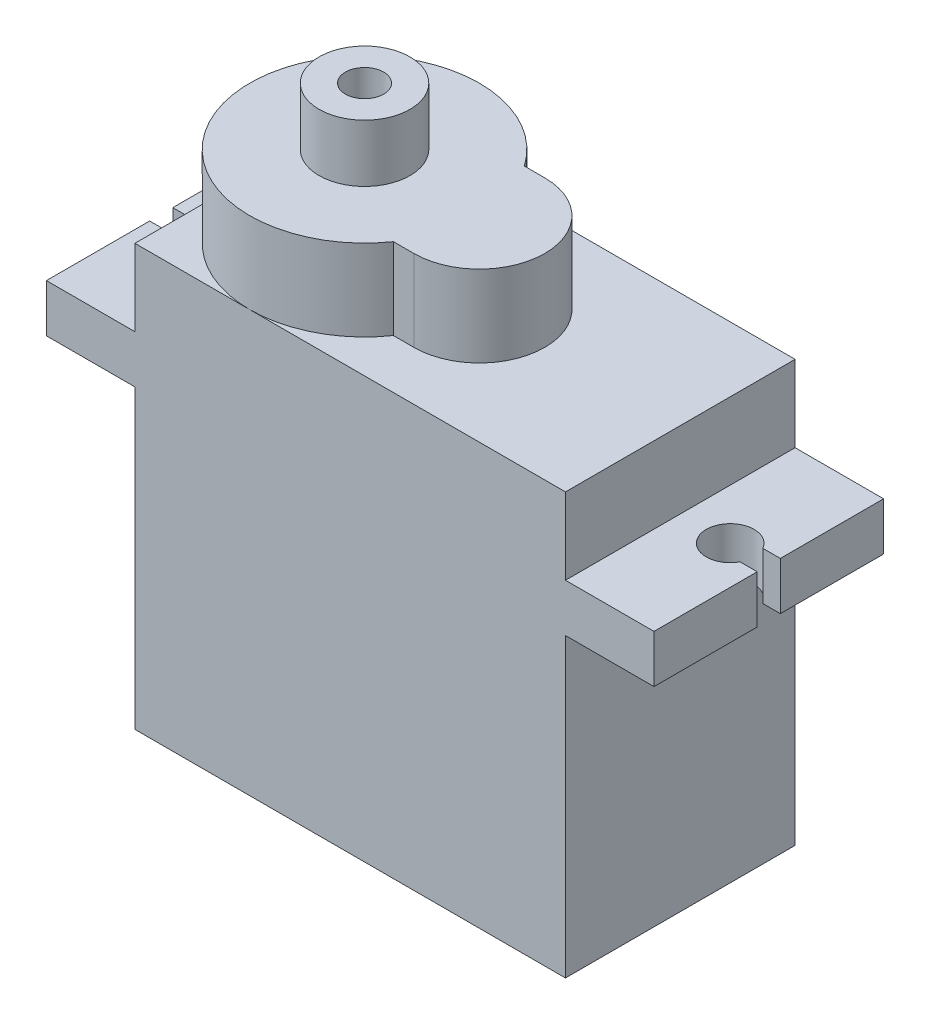
ISO-10303-21;
HEADER;
FILE_DESCRIPTION(('STEP AP214'),'2;1');
FILE_NAME('part.step','',(''),(''),'','','');
FILE_SCHEMA(('AUTOMOTIVE_DESIGN { 1 0 10303 214 1 1 1 1 }'));
ENDSEC;
DATA;
#1=APPLICATION_CONTEXT('core data for automotive mechanical design processes');
#2=APPLICATION_PROTOCOL_DEFINITION('international standard','automotive_design',2000,#1);
#3=PRODUCT_CONTEXT('',#1,'mechanical');
#4=PRODUCT('Part','Part','',(#3));
#5=PRODUCT_RELATED_PRODUCT_CATEGORY('part','',(#4));
#6=PRODUCT_DEFINITION_FORMATION('','',#4);
#7=PRODUCT_DEFINITION_CONTEXT('part definition',#1,'design');
#8=PRODUCT_DEFINITION('design','',#6,#7);
#9=PRODUCT_DEFINITION_SHAPE('','',#8);
#10=(LENGTH_UNIT() NAMED_UNIT(*) SI_UNIT(.MILLI.,.METRE.));
#11=(NAMED_UNIT(*) PLANE_ANGLE_UNIT() SI_UNIT($,.RADIAN.));
#12=(NAMED_UNIT(*) SI_UNIT($,.STERADIAN.) SOLID_ANGLE_UNIT());
#13=UNCERTAINTY_MEASURE_WITH_UNIT(LENGTH_MEASURE(1.E-05),#10,'distance_accuracy_value','');
#14=(GEOMETRIC_REPRESENTATION_CONTEXT(3) GLOBAL_UNCERTAINTY_ASSIGNED_CONTEXT((#13)) GLOBAL_UNIT_ASSIGNED_CONTEXT((#10,
#11,#12)) REPRESENTATION_CONTEXT('',''));
#15=CARTESIAN_POINT('',(0.,0.,0.));
#16=DIRECTION('',(0.,0.,1.));
#17=DIRECTION('',(1.,0.,0.));
#18=AXIS2_PLACEMENT_3D('',#15,#16,#17);
#19=CARTESIAN_POINT('',(11.43,22.352,6.096));
#20=DIRECTION('',(-1.,0.,0.));
#21=DIRECTION('',(0.,0.,1.));
#22=AXIS2_PLACEMENT_3D('',#19,#20,#21);
#23=PLANE('',#22);
#24=DIRECTION('',(0.,0.,1.));
#25=VECTOR('',#24,1.);
#26=CARTESIAN_POINT('',(11.43,18.288,6.096));
#27=LINE('',#26,#25);
#28=CARTESIAN_POINT('',(11.43,18.288,-6.096));
#29=VERTEX_POINT('',#28);
#30=CARTESIAN_POINT('',(11.43,18.288,6.096));
#31=VERTEX_POINT('',#30);
#32=EDGE_CURVE('E234',#29,#31,#27,.T.);
#33=ORIENTED_EDGE('',*,*,#32,.F.);
#34=DIRECTION('',(0.,-1.,0.));
#35=VECTOR('',#34,1.);
#36=CARTESIAN_POINT('',(11.43,22.352,-6.096));
#37=LINE('',#36,#35);
#38=CARTESIAN_POINT('',(11.43,22.352,-6.096));
#39=VERTEX_POINT('',#38);
#40=EDGE_CURVE('E470',#39,#29,#37,.T.);
#41=ORIENTED_EDGE('',*,*,#40,.F.);
#42=DIRECTION('',(0.,0.,-1.));
#43=VECTOR('',#42,1.);
#44=CARTESIAN_POINT('',(11.43,22.352,6.096));
#45=LINE('',#44,#43);
#46=CARTESIAN_POINT('',(11.43,22.352,6.096));
#47=VERTEX_POINT('',#46);
#48=EDGE_CURVE('E422',#47,#39,#45,.T.);
#49=ORIENTED_EDGE('',*,*,#48,.F.);
#50=DIRECTION('',(0.,-1.,0.));
#51=VECTOR('',#50,1.);
#52=CARTESIAN_POINT('',(11.43,22.352,6.096));
#53=LINE('',#52,#51);
#54=EDGE_CURVE('E457',#47,#31,#53,.T.);
#55=ORIENTED_EDGE('',*,*,#54,.T.);
#56=EDGE_LOOP('',(#33,#41,#49,#55));
#57=FACE_BOUND('',#56,.T.);
#58=ADVANCED_FACE('F41',(#57),#23,.F.);
#59=CARTESIAN_POINT('',(-11.43,22.352,6.096));
#60=DIRECTION('',(1.,0.,0.));
#61=DIRECTION('',(0.,0.,-1.));
#62=AXIS2_PLACEMENT_3D('',#59,#60,#61);
#63=PLANE('',#62);
#64=DIRECTION('',(0.,0.,-1.));
#65=VECTOR('',#64,1.);
#66=CARTESIAN_POINT('',(-11.43,18.288,6.096));
#67=LINE('',#66,#65);
#68=CARTESIAN_POINT('',(-11.43,18.288,6.096));
#69=VERTEX_POINT('',#68);
#70=CARTESIAN_POINT('',(-11.43,18.288,-6.096));
#71=VERTEX_POINT('',#70);
#72=EDGE_CURVE('E370',#69,#71,#67,.T.);
#73=ORIENTED_EDGE('',*,*,#72,.F.);
#74=DIRECTION('',(0.,-1.,0.));
#75=VECTOR('',#74,1.);
#76=CARTESIAN_POINT('',(-11.43,22.352,6.096));
#77=LINE('',#76,#75);
#78=CARTESIAN_POINT('',(-11.43,22.352,6.096));
#79=VERTEX_POINT('',#78);
#80=EDGE_CURVE('E461',#79,#69,#77,.T.);
#81=ORIENTED_EDGE('',*,*,#80,.F.);
#82=DIRECTION('',(0.,0.,1.));
#83=VECTOR('',#82,1.);
#84=CARTESIAN_POINT('',(-11.43,22.352,6.096));
#85=LINE('',#84,#83);
#86=CARTESIAN_POINT('',(-11.43,22.352,0.));
#87=VERTEX_POINT('',#86);
#88=EDGE_CURVE('E432',#87,#79,#85,.T.);
#89=ORIENTED_EDGE('',*,*,#88,.F.);
#90=CARTESIAN_POINT('',(-11.43,22.352,-6.096));
#91=VERTEX_POINT('',#90);
#92=EDGE_CURVE('E433',#91,#87,#85,.T.);
#93=ORIENTED_EDGE('',*,*,#92,.F.);
#94=DIRECTION('',(0.,-1.,0.));
#95=VECTOR('',#94,1.);
#96=CARTESIAN_POINT('',(-11.43,22.352,-6.096));
#97=LINE('',#96,#95);
#98=EDGE_CURVE('E466',#91,#71,#97,.T.);
#99=ORIENTED_EDGE('',*,*,#98,.T.);
#100=EDGE_LOOP('',(#73,#81,#89,#93,#99));
#101=FACE_BOUND('',#100,.T.);
#102=ADVANCED_FACE('F542',(#101),#63,.F.);
#103=CARTESIAN_POINT('',(0.,22.352,0.));
#104=DIRECTION('',(0.,-1.,0.));
#105=DIRECTION('',(0.,0.,-1.));
#106=AXIS2_PLACEMENT_3D('',#103,#104,#105);
#107=PLANE('',#106);
#108=CARTESIAN_POINT('',(-5.334,22.352,0.));
#109=DIRECTION('',(0.,1.,0.));
#110=DIRECTION('',(0.,0.,1.));
#111=AXIS2_PLACEMENT_3D('',#108,#109,#110);
#112=CIRCLE('',#111,6.096);
#113=CARTESIAN_POINT('',(-0.325986717155687,22.352,-3.47577602253869));
#114=VERTEX_POINT('',#113);
#115=CARTESIAN_POINT('',(-5.334,22.352,-6.096));
#116=VERTEX_POINT('',#115);
#117=EDGE_CURVE('E375',#114,#116,#112,.T.);
#118=ORIENTED_EDGE('',*,*,#117,.F.);
#119=DIRECTION('',(-1.,0.,0.));
#120=VECTOR('',#119,1.);
#121=CARTESIAN_POINT('',(0.761999999999996,22.352,-3.47577602253869));
#122=LINE('',#121,#120);
#123=CARTESIAN_POINT('',(0.761999999999997,22.352,-3.47577602253869));
#124=VERTEX_POINT('',#123);
#125=EDGE_CURVE('E381',#124,#114,#122,.T.);
#126=ORIENTED_EDGE('',*,*,#125,.F.);
#127=CARTESIAN_POINT('',(0.761999999999996,22.352,0.));
#128=DIRECTION('',(0.,1.,0.));
#129=DIRECTION('',(0.,0.,1.));
#130=AXIS2_PLACEMENT_3D('',#127,#128,#129);
#131=CIRCLE('',#130,3.47577602253869);
#132=CARTESIAN_POINT('',(0.761999999999996,22.352,3.47577602253869));
#133=VERTEX_POINT('',#132);
#134=EDGE_CURVE('E399',#133,#124,#131,.T.);
#135=ORIENTED_EDGE('',*,*,#134,.F.);
#136=DIRECTION('',(1.,0.,0.));
#137=VECTOR('',#136,1.);
#138=CARTESIAN_POINT('',(0.761999999999996,22.352,3.47577602253869));
#139=LINE('',#138,#137);
#140=CARTESIAN_POINT('',(-0.325986717155687,22.352,3.47577602253869));
#141=VERTEX_POINT('',#140);
#142=EDGE_CURVE('E394',#141,#133,#139,.T.);
#143=ORIENTED_EDGE('',*,*,#142,.F.);
#144=CARTESIAN_POINT('',(-5.334,22.352,6.096));
#145=VERTEX_POINT('',#144);
#146=EDGE_CURVE('E395',#145,#141,#112,.T.);
#147=ORIENTED_EDGE('',*,*,#146,.F.);
#148=DIRECTION('',(1.,0.,0.));
#149=VECTOR('',#148,1.);
#150=CARTESIAN_POINT('',(-11.43,22.352,6.096));
#151=LINE('',#150,#149);
#152=EDGE_CURVE('E437',#145,#47,#151,.T.);
#153=ORIENTED_EDGE('',*,*,#152,.T.);
#154=ORIENTED_EDGE('',*,*,#48,.T.);
#155=DIRECTION('',(-1.,0.,0.));
#156=VECTOR('',#155,1.);
#157=CARTESIAN_POINT('',(-11.43,22.352,-6.096));
#158=LINE('',#157,#156);
#159=EDGE_CURVE('E428',#39,#116,#158,.T.);
#160=ORIENTED_EDGE('',*,*,#159,.T.);
#161=EDGE_LOOP('',(#118,#126,#135,#143,#147,#153,#154,#160));
#162=FACE_BOUND('',#161,.T.);
#163=ADVANCED_FACE('F547',(#162),#107,.F.);
#164=EDGE_CURVE('E50',#116,#87,#112,.T.);
#165=ORIENTED_EDGE('',*,*,#164,.F.);
#166=EDGE_CURVE('E426',#116,#91,#158,.T.);
#167=ORIENTED_EDGE('',*,*,#166,.T.);
#168=ORIENTED_EDGE('',*,*,#92,.T.);
#169=EDGE_LOOP('',(#165,#167,#168));
#170=FACE_BOUND('',#169,.T.);
#171=ADVANCED_FACE('F556',(#170),#107,.F.);
#172=EDGE_CURVE('E478',#87,#145,#112,.T.);
#173=ORIENTED_EDGE('',*,*,#172,.F.);
#174=ORIENTED_EDGE('',*,*,#88,.T.);
#175=EDGE_CURVE('E438',#79,#145,#151,.T.);
#176=ORIENTED_EDGE('',*,*,#175,.T.);
#177=EDGE_LOOP('',(#173,#174,#176));
#178=FACE_BOUND('',#177,.T.);
#179=ADVANCED_FACE('F551',(#178),#107,.F.);
#180=CARTESIAN_POINT('',(11.43,15.748,-6.096));
#181=VERTEX_POINT('',#180);
#182=CARTESIAN_POINT('',(11.43,0.,-6.096));
#183=VERTEX_POINT('',#182);
#184=EDGE_CURVE('E469',#181,#183,#37,.T.);
#185=ORIENTED_EDGE('',*,*,#184,.F.);
#186=DIRECTION('',(0.,0.,1.));
#187=VECTOR('',#186,1.);
#188=CARTESIAN_POINT('',(11.43,15.748,6.096));
#189=LINE('',#188,#187);
#190=CARTESIAN_POINT('',(11.43,15.748,6.096));
#191=VERTEX_POINT('',#190);
#192=EDGE_CURVE('E367',#181,#191,#189,.T.);
#193=ORIENTED_EDGE('',*,*,#192,.T.);
#194=CARTESIAN_POINT('',(11.43,0.,6.096));
#195=VERTEX_POINT('',#194);
#196=EDGE_CURVE('E442',#191,#195,#53,.T.);
#197=ORIENTED_EDGE('',*,*,#196,.T.);
#198=DIRECTION('',(0.,0.,-1.));
#199=VECTOR('',#198,1.);
#200=CARTESIAN_POINT('',(11.43,0.,6.096));
#201=LINE('',#200,#199);
#202=EDGE_CURVE('E421',#195,#183,#201,.T.);
#203=ORIENTED_EDGE('',*,*,#202,.T.);
#204=EDGE_LOOP('',(#185,#193,#197,#203));
#205=FACE_BOUND('',#204,.T.);
#206=ADVANCED_FACE('F43',(#205),#23,.F.);
#207=CARTESIAN_POINT('',(-11.43,22.352,-6.096));
#208=DIRECTION('',(0.,0.,1.));
#209=DIRECTION('',(1.,0.,0.));
#210=AXIS2_PLACEMENT_3D('',#207,#208,#209);
#211=PLANE('',#210);
#212=CARTESIAN_POINT('',(-11.43,15.748,-6.096));
#213=VERTEX_POINT('',#212);
#214=CARTESIAN_POINT('',(-11.43,0.,-6.096));
#215=VERTEX_POINT('',#214);
#216=EDGE_CURVE('E465',#213,#215,#97,.T.);
#217=ORIENTED_EDGE('',*,*,#216,.F.);
#218=DIRECTION('',(1.,0.,0.));
#219=VECTOR('',#218,1.);
#220=CARTESIAN_POINT('',(-16.129,15.748,-6.096));
#221=LINE('',#220,#219);
#222=CARTESIAN_POINT('',(-16.129,15.748,-6.096));
#223=VERTEX_POINT('',#222);
#224=EDGE_CURVE('E57',#223,#213,#221,.T.);
#225=ORIENTED_EDGE('',*,*,#224,.F.);
#226=DIRECTION('',(0.,-1.,0.));
#227=VECTOR('',#226,1.);
#228=CARTESIAN_POINT('',(-16.129,18.288,-6.096));
#229=LINE('',#228,#227);
#230=CARTESIAN_POINT('',(-16.129,18.288,-6.096));
#231=VERTEX_POINT('',#230);
#232=EDGE_CURVE('E347',#231,#223,#229,.T.);
#233=ORIENTED_EDGE('',*,*,#232,.F.);
#234=DIRECTION('',(1.,0.,0.));
#235=VECTOR('',#234,1.);
#236=CARTESIAN_POINT('',(-16.129,18.288,-6.096));
#237=LINE('',#236,#235);
#238=EDGE_CURVE('E273',#231,#71,#237,.T.);
#239=ORIENTED_EDGE('',*,*,#238,.T.);
#240=ORIENTED_EDGE('',*,*,#98,.F.);
#241=ORIENTED_EDGE('',*,*,#166,.F.);
#242=ORIENTED_EDGE('',*,*,#159,.F.);
#243=ORIENTED_EDGE('',*,*,#40,.T.);
#244=CARTESIAN_POINT('',(16.129,18.288,-6.096));
#245=VERTEX_POINT('',#244);
#246=EDGE_CURVE('E272',#29,#245,#237,.T.);
#247=ORIENTED_EDGE('',*,*,#246,.T.);
#248=DIRECTION('',(0.,-1.,0.));
#249=VECTOR('',#248,1.);
#250=CARTESIAN_POINT('',(16.129,18.288,-6.096));
#251=LINE('',#250,#249);
#252=CARTESIAN_POINT('',(16.129,15.748,-6.096));
#253=VERTEX_POINT('',#252);
#254=EDGE_CURVE('E343',#245,#253,#251,.T.);
#255=ORIENTED_EDGE('',*,*,#254,.T.);
#256=EDGE_CURVE('E317',#181,#253,#221,.T.);
#257=ORIENTED_EDGE('',*,*,#256,.F.);
#258=ORIENTED_EDGE('',*,*,#184,.T.);
#259=DIRECTION('',(-1.,0.,0.));
#260=VECTOR('',#259,1.);
#261=CARTESIAN_POINT('',(-11.43,0.,-6.096));
#262=LINE('',#261,#260);
#263=EDGE_CURVE('E446',#183,#215,#262,.T.);
#264=ORIENTED_EDGE('',*,*,#263,.T.);
#265=EDGE_LOOP('',(#217,#225,#233,#239,#240,#241,#242,#243,#247,#255,#257,#258,#264));
#266=FACE_BOUND('',#265,.T.);
#267=ADVANCED_FACE('F483',(#266),#211,.F.);
#268=CARTESIAN_POINT('',(-11.43,15.748,6.096));
#269=VERTEX_POINT('',#268);
#270=CARTESIAN_POINT('',(-11.43,0.,6.096));
#271=VERTEX_POINT('',#270);
#272=EDGE_CURVE('E460',#269,#271,#77,.T.);
#273=ORIENTED_EDGE('',*,*,#272,.F.);
#274=DIRECTION('',(0.,0.,-1.));
#275=VECTOR('',#274,1.);
#276=CARTESIAN_POINT('',(-11.43,15.748,6.096));
#277=LINE('',#276,#275);
#278=EDGE_CURVE('E333',#269,#213,#277,.T.);
#279=ORIENTED_EDGE('',*,*,#278,.T.);
#280=ORIENTED_EDGE('',*,*,#216,.T.);
#281=DIRECTION('',(0.,0.,1.));
#282=VECTOR('',#281,1.);
#283=CARTESIAN_POINT('',(-11.43,0.,6.096));
#284=LINE('',#283,#282);
#285=EDGE_CURVE('E450',#215,#271,#284,.T.);
#286=ORIENTED_EDGE('',*,*,#285,.T.);
#287=EDGE_LOOP('',(#273,#279,#280,#286));
#288=FACE_BOUND('',#287,.T.);
#289=ADVANCED_FACE('F495',(#288),#63,.F.);
#290=CARTESIAN_POINT('',(-11.43,22.352,6.096));
#291=DIRECTION('',(0.,0.,-1.));
#292=DIRECTION('',(-1.,0.,0.));
#293=AXIS2_PLACEMENT_3D('',#290,#291,#292);
#294=PLANE('',#293);
#295=ORIENTED_EDGE('',*,*,#196,.F.);
#296=DIRECTION('',(-1.,0.,0.));
#297=VECTOR('',#296,1.);
#298=CARTESIAN_POINT('',(-16.129,15.748,6.096));
#299=LINE('',#298,#297);
#300=CARTESIAN_POINT('',(16.129,15.748,6.096));
#301=VERTEX_POINT('',#300);
#302=EDGE_CURVE('E65',#301,#191,#299,.T.);
#303=ORIENTED_EDGE('',*,*,#302,.F.);
#304=DIRECTION('',(0.,-1.,0.));
#305=VECTOR('',#304,1.);
#306=CARTESIAN_POINT('',(16.129,18.288,6.096));
#307=LINE('',#306,#305);
#308=CARTESIAN_POINT('',(16.129,18.288,6.096));
#309=VERTEX_POINT('',#308);
#310=EDGE_CURVE('E213',#309,#301,#307,.T.);
#311=ORIENTED_EDGE('',*,*,#310,.F.);
#312=DIRECTION('',(-1.,0.,0.));
#313=VECTOR('',#312,1.);
#314=CARTESIAN_POINT('',(-16.129,18.288,6.096));
#315=LINE('',#314,#313);
#316=EDGE_CURVE('E218',#309,#31,#315,.T.);
#317=ORIENTED_EDGE('',*,*,#316,.T.);
#318=ORIENTED_EDGE('',*,*,#54,.F.);
#319=ORIENTED_EDGE('',*,*,#152,.F.);
#320=ORIENTED_EDGE('',*,*,#175,.F.);
#321=ORIENTED_EDGE('',*,*,#80,.T.);
#322=CARTESIAN_POINT('',(-16.129,18.288,6.096));
#323=VERTEX_POINT('',#322);
#324=EDGE_CURVE('E237',#69,#323,#315,.T.);
#325=ORIENTED_EDGE('',*,*,#324,.T.);
#326=DIRECTION('',(0.,-1.,0.));
#327=VECTOR('',#326,1.);
#328=CARTESIAN_POINT('',(-16.129,18.288,6.096));
#329=LINE('',#328,#327);
#330=CARTESIAN_POINT('',(-16.129,15.748,6.096));
#331=VERTEX_POINT('',#330);
#332=EDGE_CURVE('E224',#323,#331,#329,.T.);
#333=ORIENTED_EDGE('',*,*,#332,.T.);
#334=EDGE_CURVE('E294',#269,#331,#299,.T.);
#335=ORIENTED_EDGE('',*,*,#334,.F.);
#336=ORIENTED_EDGE('',*,*,#272,.T.);
#337=DIRECTION('',(1.,0.,0.));
#338=VECTOR('',#337,1.);
#339=CARTESIAN_POINT('',(-11.43,0.,6.096));
#340=LINE('',#339,#338);
#341=EDGE_CURVE('E427',#271,#195,#340,.T.);
#342=ORIENTED_EDGE('',*,*,#341,.T.);
#343=EDGE_LOOP('',(#295,#303,#311,#317,#318,#319,#320,#321,#325,#333,#335,#336,#342));
#344=FACE_BOUND('',#343,.T.);
#345=ADVANCED_FACE('F216',(#344),#294,.F.);
#346=CARTESIAN_POINT('',(0.,0.,0.));
#347=DIRECTION('',(0.,-1.,0.));
#348=DIRECTION('',(0.,0.,-1.));
#349=AXIS2_PLACEMENT_3D('',#346,#347,#348);
#350=PLANE('',#349);
#351=ORIENTED_EDGE('',*,*,#202,.F.);
#352=ORIENTED_EDGE('',*,*,#341,.F.);
#353=ORIENTED_EDGE('',*,*,#285,.F.);
#354=ORIENTED_EDGE('',*,*,#263,.F.);
#355=EDGE_LOOP('',(#351,#352,#353,#354));
#356=FACE_BOUND('',#355,.T.);
#357=ADVANCED_FACE('F488',(#356),#350,.T.);
#358=CARTESIAN_POINT('',(-5.334,26.67,0.));
#359=DIRECTION('',(0.,-1.,0.));
#360=DIRECTION('',(0.,0.,-1.));
#361=AXIS2_PLACEMENT_3D('',#358,#359,#360);
#362=CYLINDRICAL_SURFACE('',#361,6.096);
#363=ORIENTED_EDGE('',*,*,#117,.T.);
#364=ORIENTED_EDGE('',*,*,#164,.T.);
#365=ORIENTED_EDGE('',*,*,#172,.T.);
#366=ORIENTED_EDGE('',*,*,#146,.T.);
#367=DIRECTION('',(0.,-1.,0.));
#368=VECTOR('',#367,1.);
#369=CARTESIAN_POINT('',(-0.325986717155687,26.67,3.47577602253869));
#370=LINE('',#369,#368);
#371=CARTESIAN_POINT('',(-0.325986717155687,26.67,3.47577602253869));
#372=VERTEX_POINT('',#371);
#373=EDGE_CURVE('E417',#372,#141,#370,.T.);
#374=ORIENTED_EDGE('',*,*,#373,.F.);
#375=CARTESIAN_POINT('',(-5.334,26.67,0.));
#376=DIRECTION('',(0.,1.,0.));
#377=DIRECTION('',(0.,0.,1.));
#378=AXIS2_PLACEMENT_3D('',#375,#376,#377);
#379=CIRCLE('',#378,6.096);
#380=CARTESIAN_POINT('',(-0.325986717155687,26.67,-3.47577602253869));
#381=VERTEX_POINT('',#380);
#382=EDGE_CURVE('E376',#381,#372,#379,.T.);
#383=ORIENTED_EDGE('',*,*,#382,.F.);
#384=DIRECTION('',(0.,-1.,0.));
#385=VECTOR('',#384,1.);
#386=CARTESIAN_POINT('',(-0.325986717155687,26.67,-3.47577602253869));
#387=LINE('',#386,#385);
#388=EDGE_CURVE('E390',#381,#114,#387,.T.);
#389=ORIENTED_EDGE('',*,*,#388,.T.);
#390=EDGE_LOOP('',(#363,#364,#365,#366,#374,#383,#389));
#391=FACE_BOUND('',#390,.T.);
#392=ADVANCED_FACE('F577',(#391),#362,.T.);
#393=CARTESIAN_POINT('',(0.761999999999996,26.67,3.47577602253869));
#394=DIRECTION('',(0.,0.,-1.));
#395=DIRECTION('',(-1.,0.,0.));
#396=AXIS2_PLACEMENT_3D('',#393,#394,#395);
#397=PLANE('',#396);
#398=ORIENTED_EDGE('',*,*,#142,.T.);
#399=DIRECTION('',(0.,-1.,0.));
#400=VECTOR('',#399,1.);
#401=CARTESIAN_POINT('',(0.761999999999996,26.67,3.47577602253869));
#402=LINE('',#401,#400);
#403=CARTESIAN_POINT('',(0.761999999999996,26.67,3.47577602253869));
#404=VERTEX_POINT('',#403);
#405=EDGE_CURVE('E413',#404,#133,#402,.T.);
#406=ORIENTED_EDGE('',*,*,#405,.F.);
#407=DIRECTION('',(1.,0.,0.));
#408=VECTOR('',#407,1.);
#409=CARTESIAN_POINT('',(0.761999999999996,26.67,3.47577602253869));
#410=LINE('',#409,#408);
#411=EDGE_CURVE('E380',#372,#404,#410,.T.);
#412=ORIENTED_EDGE('',*,*,#411,.F.);
#413=ORIENTED_EDGE('',*,*,#373,.T.);
#414=EDGE_LOOP('',(#398,#406,#412,#413));
#415=FACE_BOUND('',#414,.T.);
#416=ADVANCED_FACE('F586',(#415),#397,.F.);
#417=CARTESIAN_POINT('',(0.761999999999996,26.67,0.));
#418=DIRECTION('',(0.,-1.,0.));
#419=DIRECTION('',(0.,0.,-1.));
#420=AXIS2_PLACEMENT_3D('',#417,#418,#419);
#421=CYLINDRICAL_SURFACE('',#420,3.47577602253869);
#422=ORIENTED_EDGE('',*,*,#134,.T.);
#423=DIRECTION('',(0.,-1.,0.));
#424=VECTOR('',#423,1.);
#425=CARTESIAN_POINT('',(0.761999999999997,26.67,-3.47577602253869));
#426=LINE('',#425,#424);
#427=CARTESIAN_POINT('',(0.761999999999997,26.67,-3.47577602253869));
#428=VERTEX_POINT('',#427);
#429=EDGE_CURVE('E409',#428,#124,#426,.T.);
#430=ORIENTED_EDGE('',*,*,#429,.F.);
#431=CARTESIAN_POINT('',(0.761999999999996,26.67,0.));
#432=DIRECTION('',(0.,1.,0.));
#433=DIRECTION('',(0.,0.,1.));
#434=AXIS2_PLACEMENT_3D('',#431,#432,#433);
#435=CIRCLE('',#434,3.47577602253869);
#436=EDGE_CURVE('E384',#404,#428,#435,.T.);
#437=ORIENTED_EDGE('',*,*,#436,.F.);
#438=ORIENTED_EDGE('',*,*,#405,.T.);
#439=EDGE_LOOP('',(#422,#430,#437,#438));
#440=FACE_BOUND('',#439,.T.);
#441=ADVANCED_FACE('F584',(#440),#421,.T.);
#442=CARTESIAN_POINT('',(0.761999999999996,26.67,-3.47577602253869));
#443=DIRECTION('',(0.,0.,1.));
#444=DIRECTION('',(1.,0.,0.));
#445=AXIS2_PLACEMENT_3D('',#442,#443,#444);
#446=PLANE('',#445);
#447=ORIENTED_EDGE('',*,*,#125,.T.);
#448=ORIENTED_EDGE('',*,*,#388,.F.);
#449=DIRECTION('',(-1.,0.,0.));
#450=VECTOR('',#449,1.);
#451=CARTESIAN_POINT('',(0.761999999999996,26.67,-3.47577602253869));
#452=LINE('',#451,#450);
#453=EDGE_CURVE('E387',#428,#381,#452,.T.);
#454=ORIENTED_EDGE('',*,*,#453,.F.);
#455=ORIENTED_EDGE('',*,*,#429,.T.);
#456=EDGE_LOOP('',(#447,#448,#454,#455));
#457=FACE_BOUND('',#456,.T.);
#458=ADVANCED_FACE('F573',(#457),#446,.F.);
#459=CARTESIAN_POINT('',(-5.334,26.67,0.));
#460=DIRECTION('',(0.,1.,0.));
#461=DIRECTION('',(0.,0.,1.));
#462=AXIS2_PLACEMENT_3D('',#459,#460,#461);
#463=PLANE('',#462);
#464=CARTESIAN_POINT('',(-5.334,26.67,0.));
#465=DIRECTION('',(0.,1.,0.));
#466=DIRECTION('',(0.,0.,1.));
#467=AXIS2_PLACEMENT_3D('',#464,#465,#466);
#468=CIRCLE('',#467,2.413);
#469=CARTESIAN_POINT('',(-5.334,26.67,2.413));
#470=VERTEX_POINT('',#469);
#471=EDGE_CURVE('E250',#470,#470,#468,.T.);
#472=ORIENTED_EDGE('',*,*,#471,.F.);
#473=EDGE_LOOP('',(#472));
#474=FACE_BOUND('',#473,.T.);
#475=ORIENTED_EDGE('',*,*,#382,.T.);
#476=ORIENTED_EDGE('',*,*,#411,.T.);
#477=ORIENTED_EDGE('',*,*,#436,.T.);
#478=ORIENTED_EDGE('',*,*,#453,.T.);
#479=EDGE_LOOP('',(#475,#476,#477,#478));
#480=FACE_BOUND('',#479,.T.);
#481=ADVANCED_FACE('F580',(#474,#480),#463,.T.);
#482=CARTESIAN_POINT('',(-16.129,18.288,-6.096));
#483=DIRECTION('',(-1.,0.,0.));
#484=DIRECTION('',(0.,0.,1.));
#485=AXIS2_PLACEMENT_3D('',#482,#483,#484);
#486=PLANE('',#485);
#487=DIRECTION('',(0.,0.,-1.));
#488=VECTOR('',#487,1.);
#489=CARTESIAN_POINT('',(-16.129,15.748,-6.096));
#490=LINE('',#489,#488);
#491=CARTESIAN_POINT('',(-16.129,15.748,-0.613485198928188));
#492=VERTEX_POINT('',#491);
#493=EDGE_CURVE('E314',#492,#223,#490,.T.);
#494=ORIENTED_EDGE('',*,*,#493,.F.);
#495=DIRECTION('',(0.,-1.,0.));
#496=VECTOR('',#495,1.);
#497=CARTESIAN_POINT('',(-16.129,18.288,-0.613485198928188));
#498=LINE('',#497,#496);
#499=CARTESIAN_POINT('',(-16.129,18.288,-0.613485198928188));
#500=VERTEX_POINT('',#499);
#501=EDGE_CURVE('E350',#500,#492,#498,.T.);
#502=ORIENTED_EDGE('',*,*,#501,.F.);
#503=DIRECTION('',(0.,0.,-1.));
#504=VECTOR('',#503,1.);
#505=CARTESIAN_POINT('',(-16.129,18.288,-6.096));
#506=LINE('',#505,#504);
#507=EDGE_CURVE('E268',#500,#231,#506,.T.);
#508=ORIENTED_EDGE('',*,*,#507,.T.);
#509=ORIENTED_EDGE('',*,*,#232,.T.);
#510=EDGE_LOOP('',(#494,#502,#508,#509));
#511=FACE_BOUND('',#510,.T.);
#512=ADVANCED_FACE('F599',(#511),#486,.T.);
#513=CARTESIAN_POINT('',(-16.129,18.288,-0.613485198928188));
#514=DIRECTION('',(0.,0.,1.));
#515=DIRECTION('',(1.,0.,0.));
#516=AXIS2_PLACEMENT_3D('',#513,#514,#515);
#517=PLANE('',#516);
#518=DIRECTION('',(-1.,0.,0.));
#519=VECTOR('',#518,1.);
#520=CARTESIAN_POINT('',(-16.129,15.748,-0.613485198928188));
#521=LINE('',#520,#519);
#522=CARTESIAN_POINT('',(-15.1994458626541,15.748,-0.613485198928187));
#523=VERTEX_POINT('',#522);
#524=EDGE_CURVE('E310',#523,#492,#521,.T.);
#525=ORIENTED_EDGE('',*,*,#524,.F.);
#526=DIRECTION('',(0.,-1.,0.));
#527=VECTOR('',#526,1.);
#528=CARTESIAN_POINT('',(-15.1994458626541,18.288,-0.613485198928187));
#529=LINE('',#528,#527);
#530=CARTESIAN_POINT('',(-15.1994458626541,18.288,-0.613485198928187));
#531=VERTEX_POINT('',#530);
#532=EDGE_CURVE('E353',#531,#523,#529,.T.);
#533=ORIENTED_EDGE('',*,*,#532,.F.);
#534=DIRECTION('',(-1.,0.,0.));
#535=VECTOR('',#534,1.);
#536=CARTESIAN_POINT('',(-16.129,18.288,-0.613485198928188));
#537=LINE('',#536,#535);
#538=EDGE_CURVE('E264',#531,#500,#537,.T.);
#539=ORIENTED_EDGE('',*,*,#538,.T.);
#540=ORIENTED_EDGE('',*,*,#501,.T.);
#541=EDGE_LOOP('',(#525,#533,#539,#540));
#542=FACE_BOUND('',#541,.T.);
#543=ADVANCED_FACE('F617',(#542),#517,.T.);
#544=CARTESIAN_POINT('',(-14.097,18.288,0.0170012164026706));
#545=DIRECTION('',(0.,-1.,0.));
#546=DIRECTION('',(0.,0.,-1.));
#547=AXIS2_PLACEMENT_3D('',#544,#545,#546);
#548=CYLINDRICAL_SURFACE('',#547,1.27);
#549=CARTESIAN_POINT('',(-14.097,15.748,0.0170012164026706));
#550=DIRECTION('',(0.,1.,0.));
#551=DIRECTION('',(0.,0.,-1.));
#552=AXIS2_PLACEMENT_3D('',#549,#550,#551);
#553=CIRCLE('',#552,1.27);
#554=CARTESIAN_POINT('',(-15.2182077678069,15.748,0.613485198928188));
#555=VERTEX_POINT('',#554);
#556=EDGE_CURVE('E306',#555,#523,#553,.T.);
#557=ORIENTED_EDGE('',*,*,#556,.F.);
#558=DIRECTION('',(0.,-1.,0.));
#559=VECTOR('',#558,1.);
#560=CARTESIAN_POINT('',(-15.2182077678069,18.288,0.613485198928188));
#561=LINE('',#560,#559);
#562=CARTESIAN_POINT('',(-15.2182077678069,18.288,0.613485198928188));
#563=VERTEX_POINT('',#562);
#564=EDGE_CURVE('E356',#563,#555,#561,.T.);
#565=ORIENTED_EDGE('',*,*,#564,.F.);
#566=CARTESIAN_POINT('',(-14.097,18.288,0.0170012164026706));
#567=DIRECTION('',(0.,1.,0.));
#568=DIRECTION('',(0.,0.,-1.));
#569=AXIS2_PLACEMENT_3D('',#566,#567,#568);
#570=CIRCLE('',#569,1.27);
#571=EDGE_CURVE('E260',#563,#531,#570,.T.);
#572=ORIENTED_EDGE('',*,*,#571,.T.);
#573=ORIENTED_EDGE('',*,*,#532,.T.);
#574=EDGE_LOOP('',(#557,#565,#572,#573));
#575=FACE_BOUND('',#574,.T.);
#576=ADVANCED_FACE('F613',(#575),#548,.F.);
#577=CARTESIAN_POINT('',(-16.129,18.288,0.613485198928188));
#578=DIRECTION('',(0.,0.,-1.));
#579=DIRECTION('',(-1.,0.,0.));
#580=AXIS2_PLACEMENT_3D('',#577,#578,#579);
#581=PLANE('',#580);
#582=DIRECTION('',(1.,0.,0.));
#583=VECTOR('',#582,1.);
#584=CARTESIAN_POINT('',(-16.129,15.748,0.613485198928188));
#585=LINE('',#584,#583);
#586=CARTESIAN_POINT('',(-16.129,15.748,0.613485198928188));
#587=VERTEX_POINT('',#586);
#588=EDGE_CURVE('E302',#587,#555,#585,.T.);
#589=ORIENTED_EDGE('',*,*,#588,.F.);
#590=DIRECTION('',(0.,-1.,0.));
#591=VECTOR('',#590,1.);
#592=CARTESIAN_POINT('',(-16.129,18.288,0.613485198928188));
#593=LINE('',#592,#591);
#594=CARTESIAN_POINT('',(-16.129,18.288,0.613485198928188));
#595=VERTEX_POINT('',#594);
#596=EDGE_CURVE('E359',#595,#587,#593,.T.);
#597=ORIENTED_EDGE('',*,*,#596,.F.);
#598=DIRECTION('',(1.,0.,0.));
#599=VECTOR('',#598,1.);
#600=CARTESIAN_POINT('',(-16.129,18.288,0.613485198928188));
#601=LINE('',#600,#599);
#602=EDGE_CURVE('E256',#595,#563,#601,.T.);
#603=ORIENTED_EDGE('',*,*,#602,.T.);
#604=ORIENTED_EDGE('',*,*,#564,.T.);
#605=EDGE_LOOP('',(#589,#597,#603,#604));
#606=FACE_BOUND('',#605,.T.);
#607=ADVANCED_FACE('F609',(#606),#581,.T.);
#608=CARTESIAN_POINT('',(-16.129,18.288,0.613485198928188));
#609=DIRECTION('',(-1.,0.,0.));
#610=DIRECTION('',(0.,0.,1.));
#611=AXIS2_PLACEMENT_3D('',#608,#609,#610);
#612=PLANE('',#611);
#613=DIRECTION('',(0.,0.,-1.));
#614=VECTOR('',#613,1.);
#615=CARTESIAN_POINT('',(-16.129,15.748,0.613485198928188));
#616=LINE('',#615,#614);
#617=EDGE_CURVE('E298',#331,#587,#616,.T.);
#618=ORIENTED_EDGE('',*,*,#617,.F.);
#619=ORIENTED_EDGE('',*,*,#332,.F.);
#620=DIRECTION('',(0.,0.,-1.));
#621=VECTOR('',#620,1.);
#622=CARTESIAN_POINT('',(-16.129,18.288,0.613485198928188));
#623=LINE('',#622,#621);
#624=EDGE_CURVE('E236',#323,#595,#623,.T.);
#625=ORIENTED_EDGE('',*,*,#624,.T.);
#626=ORIENTED_EDGE('',*,*,#596,.T.);
#627=EDGE_LOOP('',(#618,#619,#625,#626));
#628=FACE_BOUND('',#627,.T.);
#629=ADVANCED_FACE('F605',(#628),#612,.T.);
#630=CARTESIAN_POINT('',(-14.097,15.748,0.0170012164026706));
#631=DIRECTION('',(0.,-1.,0.));
#632=DIRECTION('',(0.,0.,-1.));
#633=AXIS2_PLACEMENT_3D('',#630,#631,#632);
#634=PLANE('',#633);
#635=ORIENTED_EDGE('',*,*,#278,.F.);
#636=ORIENTED_EDGE('',*,*,#334,.T.);
#637=ORIENTED_EDGE('',*,*,#617,.T.);
#638=ORIENTED_EDGE('',*,*,#588,.T.);
#639=ORIENTED_EDGE('',*,*,#556,.T.);
#640=ORIENTED_EDGE('',*,*,#524,.T.);
#641=ORIENTED_EDGE('',*,*,#493,.T.);
#642=ORIENTED_EDGE('',*,*,#224,.T.);
#643=EDGE_LOOP('',(#635,#636,#637,#638,#639,#640,#641,#642));
#644=FACE_BOUND('',#643,.T.);
#645=ADVANCED_FACE('F608',(#644),#634,.T.);
#646=CARTESIAN_POINT('',(-14.097,18.288,0.0170012164026706));
#647=DIRECTION('',(0.,-1.,0.));
#648=DIRECTION('',(0.,0.,-1.));
#649=AXIS2_PLACEMENT_3D('',#646,#647,#648);
#650=PLANE('',#649);
#651=ORIENTED_EDGE('',*,*,#324,.F.);
#652=ORIENTED_EDGE('',*,*,#72,.T.);
#653=ORIENTED_EDGE('',*,*,#238,.F.);
#654=ORIENTED_EDGE('',*,*,#507,.F.);
#655=ORIENTED_EDGE('',*,*,#538,.F.);
#656=ORIENTED_EDGE('',*,*,#571,.F.);
#657=ORIENTED_EDGE('',*,*,#602,.F.);
#658=ORIENTED_EDGE('',*,*,#624,.F.);
#659=EDGE_LOOP('',(#651,#652,#653,#654,#655,#656,#657,#658));
#660=FACE_BOUND('',#659,.T.);
#661=ADVANCED_FACE('F637',(#660),#650,.F.);
#662=ORIENTED_EDGE('',*,*,#246,.F.);
#663=ORIENTED_EDGE('',*,*,#32,.T.);
#664=ORIENTED_EDGE('',*,*,#316,.F.);
#665=DIRECTION('',(0.,0.,1.));
#666=VECTOR('',#665,1.);
#667=CARTESIAN_POINT('',(16.129,18.288,0.613485198928188));
#668=LINE('',#667,#666);
#669=CARTESIAN_POINT('',(16.129,18.288,0.613485198928188));
#670=VERTEX_POINT('',#669);
#671=EDGE_CURVE('E231',#670,#309,#668,.T.);
#672=ORIENTED_EDGE('',*,*,#671,.F.);
#673=DIRECTION('',(1.,0.,0.));
#674=VECTOR('',#673,1.);
#675=CARTESIAN_POINT('',(16.129,18.288,0.613485198928188));
#676=LINE('',#675,#674);
#677=CARTESIAN_POINT('',(15.2182077678069,18.288,0.613485198928187));
#678=VERTEX_POINT('',#677);
#679=EDGE_CURVE('E225',#678,#670,#676,.T.);
#680=ORIENTED_EDGE('',*,*,#679,.F.);
#681=CARTESIAN_POINT('',(14.097,18.288,0.0170012164026706));
#682=DIRECTION('',(0.,1.,0.));
#683=DIRECTION('',(0.,0.,1.));
#684=AXIS2_PLACEMENT_3D('',#681,#682,#683);
#685=CIRCLE('',#684,1.27);
#686=CARTESIAN_POINT('',(15.1994458626541,18.288,-0.613485198928188));
#687=VERTEX_POINT('',#686);
#688=EDGE_CURVE('E285',#687,#678,#685,.T.);
#689=ORIENTED_EDGE('',*,*,#688,.F.);
#690=DIRECTION('',(-1.,0.,0.));
#691=VECTOR('',#690,1.);
#692=CARTESIAN_POINT('',(16.129,18.288,-0.613485198928188));
#693=LINE('',#692,#691);
#694=CARTESIAN_POINT('',(16.129,18.288,-0.613485198928188));
#695=VERTEX_POINT('',#694);
#696=EDGE_CURVE('E281',#695,#687,#693,.T.);
#697=ORIENTED_EDGE('',*,*,#696,.F.);
#698=DIRECTION('',(0.,0.,1.));
#699=VECTOR('',#698,1.);
#700=CARTESIAN_POINT('',(16.129,18.288,-6.096));
#701=LINE('',#700,#699);
#702=EDGE_CURVE('E277',#245,#695,#701,.T.);
#703=ORIENTED_EDGE('',*,*,#702,.F.);
#704=EDGE_LOOP('',(#662,#663,#664,#672,#680,#689,#697,#703));
#705=FACE_BOUND('',#704,.T.);
#706=ADVANCED_FACE('F229',(#705),#650,.F.);
#707=ORIENTED_EDGE('',*,*,#192,.F.);
#708=ORIENTED_EDGE('',*,*,#256,.T.);
#709=DIRECTION('',(0.,0.,1.));
#710=VECTOR('',#709,1.);
#711=CARTESIAN_POINT('',(16.129,15.748,-6.096));
#712=LINE('',#711,#710);
#713=CARTESIAN_POINT('',(16.129,15.748,-0.613485198928188));
#714=VERTEX_POINT('',#713);
#715=EDGE_CURVE('E320',#253,#714,#712,.T.);
#716=ORIENTED_EDGE('',*,*,#715,.T.);
#717=DIRECTION('',(-1.,0.,0.));
#718=VECTOR('',#717,1.);
#719=CARTESIAN_POINT('',(16.129,15.748,-0.613485198928188));
#720=LINE('',#719,#718);
#721=CARTESIAN_POINT('',(15.1994458626541,15.748,-0.613485198928188));
#722=VERTEX_POINT('',#721);
#723=EDGE_CURVE('E324',#714,#722,#720,.T.);
#724=ORIENTED_EDGE('',*,*,#723,.T.);
#725=CARTESIAN_POINT('',(14.097,15.748,0.0170012164026706));
#726=DIRECTION('',(0.,1.,0.));
#727=DIRECTION('',(0.,0.,1.));
#728=AXIS2_PLACEMENT_3D('',#725,#726,#727);
#729=CIRCLE('',#728,1.27);
#730=CARTESIAN_POINT('',(15.2182077678069,15.748,0.613485198928187));
#731=VERTEX_POINT('',#730);
#732=EDGE_CURVE('E247',#722,#731,#729,.T.);
#733=ORIENTED_EDGE('',*,*,#732,.T.);
#734=DIRECTION('',(1.,0.,0.));
#735=VECTOR('',#734,1.);
#736=CARTESIAN_POINT('',(16.129,15.748,0.613485198928188));
#737=LINE('',#736,#735);
#738=CARTESIAN_POINT('',(16.129,15.748,0.613485198928188));
#739=VERTEX_POINT('',#738);
#740=EDGE_CURVE('E242',#731,#739,#737,.T.);
#741=ORIENTED_EDGE('',*,*,#740,.T.);
#742=DIRECTION('',(0.,0.,1.));
#743=VECTOR('',#742,1.);
#744=CARTESIAN_POINT('',(16.129,15.748,0.613485198928188));
#745=LINE('',#744,#743);
#746=EDGE_CURVE('E291',#739,#301,#745,.T.);
#747=ORIENTED_EDGE('',*,*,#746,.T.);
#748=ORIENTED_EDGE('',*,*,#302,.T.);
#749=EDGE_LOOP('',(#707,#708,#716,#724,#733,#741,#747,#748));
#750=FACE_BOUND('',#749,.T.);
#751=ADVANCED_FACE('F512',(#750),#634,.T.);
#752=CARTESIAN_POINT('',(16.129,18.288,0.613485198928188));
#753=DIRECTION('',(1.,0.,0.));
#754=DIRECTION('',(0.,0.,-1.));
#755=AXIS2_PLACEMENT_3D('',#752,#753,#754);
#756=PLANE('',#755);
#757=ORIENTED_EDGE('',*,*,#746,.F.);
#758=DIRECTION('',(0.,-1.,0.));
#759=VECTOR('',#758,1.);
#760=CARTESIAN_POINT('',(16.129,18.288,0.613485198928188));
#761=LINE('',#760,#759);
#762=EDGE_CURVE('E240',#670,#739,#761,.T.);
#763=ORIENTED_EDGE('',*,*,#762,.F.);
#764=ORIENTED_EDGE('',*,*,#671,.T.);
#765=ORIENTED_EDGE('',*,*,#310,.T.);
#766=EDGE_LOOP('',(#757,#763,#764,#765));
#767=FACE_BOUND('',#766,.T.);
#768=ADVANCED_FACE('F239',(#767),#756,.T.);
#769=CARTESIAN_POINT('',(16.129,18.288,0.613485198928188));
#770=DIRECTION('',(0.,0.,-1.));
#771=DIRECTION('',(-1.,0.,0.));
#772=AXIS2_PLACEMENT_3D('',#769,#770,#771);
#773=PLANE('',#772);
#774=ORIENTED_EDGE('',*,*,#740,.F.);
#775=DIRECTION('',(0.,-1.,0.));
#776=VECTOR('',#775,1.);
#777=CARTESIAN_POINT('',(15.2182077678069,18.288,0.613485198928187));
#778=LINE('',#777,#776);
#779=EDGE_CURVE('E334',#678,#731,#778,.T.);
#780=ORIENTED_EDGE('',*,*,#779,.F.);
#781=ORIENTED_EDGE('',*,*,#679,.T.);
#782=ORIENTED_EDGE('',*,*,#762,.T.);
#783=EDGE_LOOP('',(#774,#780,#781,#782));
#784=FACE_BOUND('',#783,.T.);
#785=ADVANCED_FACE('F604',(#784),#773,.T.);
#786=CARTESIAN_POINT('',(14.097,18.288,0.0170012164026706));
#787=DIRECTION('',(0.,-1.,0.));
#788=DIRECTION('',(0.,0.,-1.));
#789=AXIS2_PLACEMENT_3D('',#786,#787,#788);
#790=CYLINDRICAL_SURFACE('',#789,1.27);
#791=ORIENTED_EDGE('',*,*,#732,.F.);
#792=DIRECTION('',(0.,-1.,0.));
#793=VECTOR('',#792,1.);
#794=CARTESIAN_POINT('',(15.1994458626541,18.288,-0.613485198928188));
#795=LINE('',#794,#793);
#796=EDGE_CURVE('E337',#687,#722,#795,.T.);
#797=ORIENTED_EDGE('',*,*,#796,.F.);
#798=ORIENTED_EDGE('',*,*,#688,.T.);
#799=ORIENTED_EDGE('',*,*,#779,.T.);
#800=EDGE_LOOP('',(#791,#797,#798,#799));
#801=FACE_BOUND('',#800,.T.);
#802=ADVANCED_FACE('F627',(#801),#790,.F.);
#803=CARTESIAN_POINT('',(16.129,18.288,-0.613485198928188));
#804=DIRECTION('',(0.,0.,1.));
#805=DIRECTION('',(1.,0.,0.));
#806=AXIS2_PLACEMENT_3D('',#803,#804,#805);
#807=PLANE('',#806);
#808=ORIENTED_EDGE('',*,*,#723,.F.);
#809=DIRECTION('',(0.,-1.,0.));
#810=VECTOR('',#809,1.);
#811=CARTESIAN_POINT('',(16.129,18.288,-0.613485198928188));
#812=LINE('',#811,#810);
#813=EDGE_CURVE('E340',#695,#714,#812,.T.);
#814=ORIENTED_EDGE('',*,*,#813,.F.);
#815=ORIENTED_EDGE('',*,*,#696,.T.);
#816=ORIENTED_EDGE('',*,*,#796,.T.);
#817=EDGE_LOOP('',(#808,#814,#815,#816));
#818=FACE_BOUND('',#817,.T.);
#819=ADVANCED_FACE('F510',(#818),#807,.T.);
#820=CARTESIAN_POINT('',(16.129,18.288,-6.096));
#821=DIRECTION('',(1.,0.,0.));
#822=DIRECTION('',(0.,0.,-1.));
#823=AXIS2_PLACEMENT_3D('',#820,#821,#822);
#824=PLANE('',#823);
#825=ORIENTED_EDGE('',*,*,#715,.F.);
#826=ORIENTED_EDGE('',*,*,#254,.F.);
#827=ORIENTED_EDGE('',*,*,#702,.T.);
#828=ORIENTED_EDGE('',*,*,#813,.T.);
#829=EDGE_LOOP('',(#825,#826,#827,#828));
#830=FACE_BOUND('',#829,.T.);
#831=ADVANCED_FACE('F505',(#830),#824,.T.);
#832=CARTESIAN_POINT('',(-5.334,29.718,0.));
#833=DIRECTION('',(0.,1.,0.));
#834=DIRECTION('',(0.,0.,1.));
#835=AXIS2_PLACEMENT_3D('',#832,#833,#834);
#836=PLANE('',#835);
#837=CARTESIAN_POINT('',(-5.334,29.718,0.));
#838=DIRECTION('',(0.,1.,0.));
#839=DIRECTION('',(0.,0.,1.));
#840=AXIS2_PLACEMENT_3D('',#837,#838,#839);
#841=CIRCLE('',#840,2.413);
#842=CARTESIAN_POINT('',(-5.334,29.718,2.413));
#843=VERTEX_POINT('',#842);
#844=EDGE_CURVE('E295',#843,#843,#841,.T.);
#845=ORIENTED_EDGE('',*,*,#844,.T.);
#846=EDGE_LOOP('',(#845));
#847=FACE_BOUND('',#846,.T.);
#848=CARTESIAN_POINT('',(-5.334,29.718,0.));
#849=DIRECTION('',(0.,1.,0.));
#850=DIRECTION('',(0.,0.,1.));
#851=AXIS2_PLACEMENT_3D('',#848,#849,#850);
#852=CIRCLE('',#851,1.016);
#853=CARTESIAN_POINT('',(-5.334,29.718,1.016));
#854=VERTEX_POINT('',#853);
#855=EDGE_CURVE('E520',#854,#854,#852,.T.);
#856=ORIENTED_EDGE('',*,*,#855,.F.);
#857=EDGE_LOOP('',(#856));
#858=FACE_BOUND('',#857,.T.);
#859=ADVANCED_FACE('F528',(#847,#858),#836,.T.);
#860=CARTESIAN_POINT('',(-5.334,29.718,0.));
#861=DIRECTION('',(0.,-1.,0.));
#862=DIRECTION('',(0.,0.,-1.));
#863=AXIS2_PLACEMENT_3D('',#860,#861,#862);
#864=CYLINDRICAL_SURFACE('',#863,2.413);
#865=ORIENTED_EDGE('',*,*,#844,.F.);
#866=EDGE_LOOP('',(#865));
#867=FACE_BOUND('',#866,.T.);
#868=ORIENTED_EDGE('',*,*,#471,.T.);
#869=EDGE_LOOP('',(#868));
#870=FACE_BOUND('',#869,.T.);
#871=ADVANCED_FACE('F530',(#867,#870),#864,.T.);
#872=CARTESIAN_POINT('',(-5.334,29.718,0.));
#873=DIRECTION('',(0.,-1.,0.));
#874=DIRECTION('',(0.,0.,-1.));
#875=AXIS2_PLACEMENT_3D('',#872,#873,#874);
#876=CYLINDRICAL_SURFACE('',#875,1.016);
#877=ORIENTED_EDGE('',*,*,#855,.T.);
#878=EDGE_LOOP('',(#877));
#879=FACE_BOUND('',#878,.T.);
#880=CARTESIAN_POINT('',(-5.334,26.67,0.));
#881=DIRECTION('',(0.,1.,0.));
#882=DIRECTION('',(0.,0.,1.));
#883=AXIS2_PLACEMENT_3D('',#880,#881,#882);
#884=CIRCLE('',#883,1.016);
#885=CARTESIAN_POINT('',(-5.334,26.67,1.016));
#886=VERTEX_POINT('',#885);
#887=EDGE_CURVE('E11',#886,#886,#884,.F.);
#888=ORIENTED_EDGE('',*,*,#887,.T.);
#889=EDGE_LOOP('',(#888));
#890=FACE_BOUND('',#889,.T.);
#891=ADVANCED_FACE('F525',(#879,#890),#876,.F.);
#892=ORIENTED_EDGE('',*,*,#887,.F.);
#893=EDGE_LOOP('',(#892));
#894=FACE_BOUND('',#893,.T.);
#895=ADVANCED_FACE('F601',(#894),#463,.T.);
#896=CLOSED_SHELL('',(#58,#102,#163,#171,#179,#206,#267,#289,#345,#357,#392,#416,#441,#458,#481,
#512,#543,#576,#607,#629,#645,#661,#706,#751,#768,#785,#802,#819,#831,#859,#871,#891,#895));
#897=MANIFOLD_SOLID_BREP('B2',#896);
#898=ADVANCED_BREP_SHAPE_REPRESENTATION('',(#18,#897),#14);
#899=SHAPE_DEFINITION_REPRESENTATION(#9,#898);
ENDSEC;
END-ISO-10303-21;
